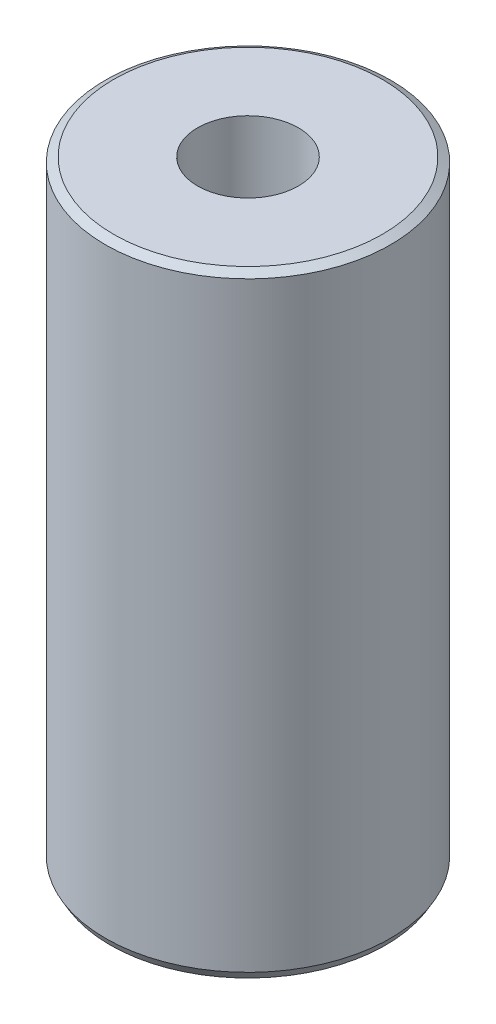
ISO-10303-21;
HEADER;
FILE_DESCRIPTION(('STEP AP214'),'2;1');
FILE_NAME('part.step','',(''),(''),'','','');
FILE_SCHEMA(('AUTOMOTIVE_DESIGN { 1 0 10303 214 1 1 1 1 }'));
ENDSEC;
DATA;
#1=APPLICATION_CONTEXT('core data for automotive mechanical design processes');
#2=APPLICATION_PROTOCOL_DEFINITION('international standard','automotive_design',2000,#1);
#3=PRODUCT_CONTEXT('',#1,'mechanical');
#4=PRODUCT('Part','Part','',(#3));
#5=PRODUCT_RELATED_PRODUCT_CATEGORY('part','',(#4));
#6=PRODUCT_DEFINITION_FORMATION('','',#4);
#7=PRODUCT_DEFINITION_CONTEXT('part definition',#1,'design');
#8=PRODUCT_DEFINITION('design','',#6,#7);
#9=PRODUCT_DEFINITION_SHAPE('','',#8);
#10=(LENGTH_UNIT() NAMED_UNIT(*) SI_UNIT(.MILLI.,.METRE.));
#11=(NAMED_UNIT(*) PLANE_ANGLE_UNIT() SI_UNIT($,.RADIAN.));
#12=(NAMED_UNIT(*) SI_UNIT($,.STERADIAN.) SOLID_ANGLE_UNIT());
#13=UNCERTAINTY_MEASURE_WITH_UNIT(LENGTH_MEASURE(1.E-05),#10,'distance_accuracy_value','');
#14=(GEOMETRIC_REPRESENTATION_CONTEXT(3) GLOBAL_UNCERTAINTY_ASSIGNED_CONTEXT((#13)) GLOBAL_UNIT_ASSIGNED_CONTEXT((#10,
#11,#12)) REPRESENTATION_CONTEXT('',''));
#15=CARTESIAN_POINT('',(0.,0.,0.));
#16=DIRECTION('',(0.,0.,1.));
#17=DIRECTION('',(1.,0.,0.));
#18=AXIS2_PLACEMENT_3D('',#15,#16,#17);
#19=CARTESIAN_POINT('',(0.,258.179872806348,0.));
#20=DIRECTION('',(0.,-1.,0.));
#21=DIRECTION('',(0.,0.,-1.));
#22=AXIS2_PLACEMENT_3D('',#19,#20,#21);
#23=CYLINDRICAL_SURFACE('',#22,60.);
#24=CARTESIAN_POINT('',(0.,256.160456402362,0.));
#25=DIRECTION('',(0.,1.,0.));
#26=DIRECTION('',(0.,0.,1.));
#27=AXIS2_PLACEMENT_3D('',#24,#25,#26);
#28=CIRCLE('',#27,60.);
#29=CARTESIAN_POINT('',(0.,256.160456402362,60.));
#30=VERTEX_POINT('',#29);
#31=EDGE_CURVE('E50',#30,#30,#28,.F.);
#32=ORIENTED_EDGE('',*,*,#31,.T.);
#33=EDGE_LOOP('',(#32));
#34=FACE_BOUND('',#33,.T.);
#35=CARTESIAN_POINT('',(0.,3.49773181334156,0.));
#36=DIRECTION('',(0.,1.,0.));
#37=DIRECTION('',(0.,0.,1.));
#38=AXIS2_PLACEMENT_3D('',#35,#36,#37);
#39=CIRCLE('',#38,60.);
#40=CARTESIAN_POINT('',(0.,3.49773181334156,60.));
#41=VERTEX_POINT('',#40);
#42=EDGE_CURVE('E51',#41,#41,#39,.T.);
#43=ORIENTED_EDGE('',*,*,#42,.T.);
#44=EDGE_LOOP('',(#43));
#45=FACE_BOUND('',#44,.T.);
#46=ADVANCED_FACE('F39',(#34,#45),#23,.T.);
#47=CARTESIAN_POINT('',(0.,258.179872806348,0.));
#48=DIRECTION('',(0.,1.,0.));
#49=DIRECTION('',(0.,0.,1.));
#50=AXIS2_PLACEMENT_3D('',#47,#48,#49);
#51=PLANE('',#50);
#52=CARTESIAN_POINT('',(0.,258.179872806348,0.));
#53=DIRECTION('',(0.,1.,0.));
#54=DIRECTION('',(0.,0.,1.));
#55=AXIS2_PLACEMENT_3D('',#52,#53,#54);
#56=CIRCLE('',#55,56.5022681866583);
#57=CARTESIAN_POINT('',(0.,258.179872806348,56.5022681866583));
#58=VERTEX_POINT('',#57);
#59=EDGE_CURVE('E54',#58,#58,#56,.T.);
#60=ORIENTED_EDGE('',*,*,#59,.T.);
#61=EDGE_LOOP('',(#60));
#62=FACE_BOUND('',#61,.T.);
#63=CARTESIAN_POINT('',(0.,258.179872806348,0.));
#64=DIRECTION('',(0.,1.,0.));
#65=DIRECTION('',(0.,0.,1.));
#66=AXIS2_PLACEMENT_3D('',#63,#64,#65);
#67=CIRCLE('',#66,21.2243641424127);
#68=CARTESIAN_POINT('',(0.,258.179872806348,21.2243641424127));
#69=VERTEX_POINT('',#68);
#70=EDGE_CURVE('E58',#69,#69,#67,.T.);
#71=ORIENTED_EDGE('',*,*,#70,.F.);
#72=EDGE_LOOP('',(#71));
#73=FACE_BOUND('',#72,.T.);
#74=ADVANCED_FACE('F69',(#62,#73),#51,.T.);
#75=CARTESIAN_POINT('',(0.,0.,0.));
#76=DIRECTION('',(0.,1.,0.));
#77=DIRECTION('',(0.,0.,1.));
#78=AXIS2_PLACEMENT_3D('',#75,#76,#77);
#79=PLANE('',#78);
#80=CARTESIAN_POINT('',(0.,0.,0.));
#81=DIRECTION('',(0.,1.,0.));
#82=DIRECTION('',(0.,0.,1.));
#83=AXIS2_PLACEMENT_3D('',#80,#81,#82);
#84=CIRCLE('',#83,57.9805835960141);
#85=CARTESIAN_POINT('',(0.,0.,57.9805835960141));
#86=VERTEX_POINT('',#85);
#87=EDGE_CURVE('E10',#86,#86,#84,.F.);
#88=ORIENTED_EDGE('',*,*,#87,.T.);
#89=EDGE_LOOP('',(#88));
#90=FACE_BOUND('',#89,.T.);
#91=CARTESIAN_POINT('',(0.,0.,0.));
#92=DIRECTION('',(0.,1.,0.));
#93=DIRECTION('',(0.,0.,1.));
#94=AXIS2_PLACEMENT_3D('',#91,#92,#93);
#95=CIRCLE('',#94,21.2243641424127);
#96=CARTESIAN_POINT('',(0.,0.,21.2243641424127));
#97=VERTEX_POINT('',#96);
#98=EDGE_CURVE('E63',#97,#97,#95,.T.);
#99=ORIENTED_EDGE('',*,*,#98,.T.);
#100=EDGE_LOOP('',(#99));
#101=FACE_BOUND('',#100,.T.);
#102=ADVANCED_FACE('F75',(#90,#101),#79,.F.);
#103=CARTESIAN_POINT('',(0.,258.179872806348,0.));
#104=DIRECTION('',(0.,-1.,0.));
#105=DIRECTION('',(0.,0.,-1.));
#106=AXIS2_PLACEMENT_3D('',#103,#104,#105);
#107=CYLINDRICAL_SURFACE('',#106,21.2243641424127);
#108=ORIENTED_EDGE('',*,*,#70,.T.);
#109=EDGE_LOOP('',(#108));
#110=FACE_BOUND('',#109,.T.);
#111=ORIENTED_EDGE('',*,*,#98,.F.);
#112=EDGE_LOOP('',(#111));
#113=FACE_BOUND('',#112,.T.);
#114=ADVANCED_FACE('F70',(#110,#113),#107,.F.);
#115=CARTESIAN_POINT('',(0.,258.179872806348,0.));
#116=DIRECTION('',(0.,-1.,0.));
#117=DIRECTION('',(0.,0.,-1.));
#118=AXIS2_PLACEMENT_3D('',#115,#116,#117);
#119=CONICAL_SURFACE('',#118,56.5022681866583,1.04719755119659);
#120=ORIENTED_EDGE('',*,*,#31,.F.);
#121=EDGE_LOOP('',(#120));
#122=FACE_BOUND('',#121,.T.);
#123=ORIENTED_EDGE('',*,*,#59,.F.);
#124=EDGE_LOOP('',(#123));
#125=FACE_BOUND('',#124,.T.);
#126=ADVANCED_FACE('F81',(#122,#125),#119,.T.);
#127=CARTESIAN_POINT('',(0.,3.49773181334156,0.));
#128=DIRECTION('',(0.,1.,0.));
#129=DIRECTION('',(0.,0.,1.));
#130=AXIS2_PLACEMENT_3D('',#127,#128,#129);
#131=CONICAL_SURFACE('',#130,60.,0.523598775598301);
#132=ORIENTED_EDGE('',*,*,#87,.F.);
#133=EDGE_LOOP('',(#132));
#134=FACE_BOUND('',#133,.T.);
#135=ORIENTED_EDGE('',*,*,#42,.F.);
#136=EDGE_LOOP('',(#135));
#137=FACE_BOUND('',#136,.T.);
#138=ADVANCED_FACE('F45',(#134,#137),#131,.T.);
#139=CLOSED_SHELL('',(#46,#74,#102,#114,#126,#138));
#140=MANIFOLD_SOLID_BREP('B2',#139);
#141=ADVANCED_BREP_SHAPE_REPRESENTATION('',(#18,#140),#14);
#142=SHAPE_DEFINITION_REPRESENTATION(#9,#141);
ENDSEC;
END-ISO-10303-21;
